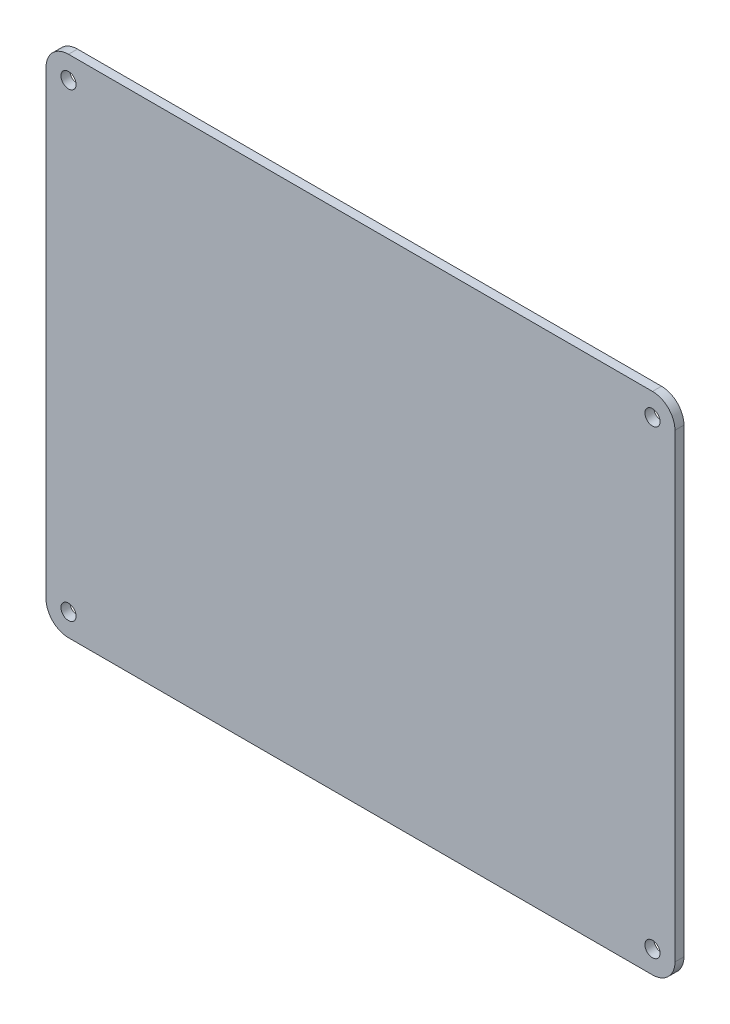
ISO-10303-21;
HEADER;
FILE_DESCRIPTION(('STEP AP214'),'2;1');
FILE_NAME('part.step','',(''),(''),'','','');
FILE_SCHEMA(('AUTOMOTIVE_DESIGN { 1 0 10303 214 1 1 1 1 }'));
ENDSEC;
DATA;
#1=APPLICATION_CONTEXT('core data for automotive mechanical design processes');
#2=APPLICATION_PROTOCOL_DEFINITION('international standard','automotive_design',2000,#1);
#3=PRODUCT_CONTEXT('',#1,'mechanical');
#4=PRODUCT('Part','Part','',(#3));
#5=PRODUCT_RELATED_PRODUCT_CATEGORY('part','',(#4));
#6=PRODUCT_DEFINITION_FORMATION('','',#4);
#7=PRODUCT_DEFINITION_CONTEXT('part definition',#1,'design');
#8=PRODUCT_DEFINITION('design','',#6,#7);
#9=PRODUCT_DEFINITION_SHAPE('','',#8);
#10=(LENGTH_UNIT() NAMED_UNIT(*) SI_UNIT(.MILLI.,.METRE.));
#11=(NAMED_UNIT(*) PLANE_ANGLE_UNIT() SI_UNIT($,.RADIAN.));
#12=(NAMED_UNIT(*) SI_UNIT($,.STERADIAN.) SOLID_ANGLE_UNIT());
#13=UNCERTAINTY_MEASURE_WITH_UNIT(LENGTH_MEASURE(1.E-05),#10,'distance_accuracy_value','');
#14=(GEOMETRIC_REPRESENTATION_CONTEXT(3) GLOBAL_UNCERTAINTY_ASSIGNED_CONTEXT((#13)) GLOBAL_UNIT_ASSIGNED_CONTEXT((#10,
#11,#12)) REPRESENTATION_CONTEXT('',''));
#15=CARTESIAN_POINT('',(0.,0.,0.));
#16=DIRECTION('',(0.,0.,1.));
#17=DIRECTION('',(1.,0.,0.));
#18=AXIS2_PLACEMENT_3D('',#15,#16,#17);
#19=CARTESIAN_POINT('',(-52.,-41.,1.6));
#20=DIRECTION('',(0.,0.,1.));
#21=DIRECTION('',(1.,0.,0.));
#22=AXIS2_PLACEMENT_3D('',#19,#20,#21);
#23=PLANE('',#22);
#24=CARTESIAN_POINT('',(52.,-41.,1.6));
#25=DIRECTION('',(0.,0.,1.));
#26=DIRECTION('',(1.,0.,0.));
#27=AXIS2_PLACEMENT_3D('',#24,#25,#26);
#28=CIRCLE('',#27,1.35000000000001);
#29=CARTESIAN_POINT('',(53.35,-41.,1.6));
#30=VERTEX_POINT('',#29);
#31=EDGE_CURVE('E188',#30,#30,#28,.T.);
#32=ORIENTED_EDGE('',*,*,#31,.F.);
#33=EDGE_LOOP('',(#32));
#34=FACE_BOUND('',#33,.T.);
#35=CARTESIAN_POINT('',(-52.,41.,1.6));
#36=DIRECTION('',(0.,0.,1.));
#37=DIRECTION('',(1.,0.,0.));
#38=AXIS2_PLACEMENT_3D('',#35,#36,#37);
#39=CIRCLE('',#38,1.35);
#40=CARTESIAN_POINT('',(-50.65,41.,1.6));
#41=VERTEX_POINT('',#40);
#42=EDGE_CURVE('E134',#41,#41,#39,.T.);
#43=ORIENTED_EDGE('',*,*,#42,.F.);
#44=EDGE_LOOP('',(#43));
#45=FACE_BOUND('',#44,.T.);
#46=CARTESIAN_POINT('',(-52.,-41.,1.6));
#47=DIRECTION('',(0.,0.,1.));
#48=DIRECTION('',(1.,0.,0.));
#49=AXIS2_PLACEMENT_3D('',#46,#47,#48);
#50=CIRCLE('',#49,4.);
#51=CARTESIAN_POINT('',(-56.,-41.,1.6));
#52=VERTEX_POINT('',#51);
#53=CARTESIAN_POINT('',(-52.,-45.,1.6));
#54=VERTEX_POINT('',#53);
#55=EDGE_CURVE('E145',#52,#54,#50,.T.);
#56=ORIENTED_EDGE('',*,*,#55,.T.);
#57=DIRECTION('',(1.,0.,0.));
#58=VECTOR('',#57,1.);
#59=CARTESIAN_POINT('',(-52.,-45.,1.6));
#60=LINE('',#59,#58);
#61=CARTESIAN_POINT('',(52.,-45.,1.6));
#62=VERTEX_POINT('',#61);
#63=EDGE_CURVE('E93',#54,#62,#60,.T.);
#64=ORIENTED_EDGE('',*,*,#63,.T.);
#65=CARTESIAN_POINT('',(52.,-41.,1.6));
#66=DIRECTION('',(0.,0.,1.));
#67=DIRECTION('',(1.,0.,0.));
#68=AXIS2_PLACEMENT_3D('',#65,#66,#67);
#69=CIRCLE('',#68,4.);
#70=CARTESIAN_POINT('',(56.,-41.,1.6));
#71=VERTEX_POINT('',#70);
#72=EDGE_CURVE('E160',#62,#71,#69,.T.);
#73=ORIENTED_EDGE('',*,*,#72,.T.);
#74=DIRECTION('',(0.,1.,0.));
#75=VECTOR('',#74,1.);
#76=CARTESIAN_POINT('',(56.,-41.,1.6));
#77=LINE('',#76,#75);
#78=CARTESIAN_POINT('',(56.,41.,1.6));
#79=VERTEX_POINT('',#78);
#80=EDGE_CURVE('E173',#71,#79,#77,.T.);
#81=ORIENTED_EDGE('',*,*,#80,.T.);
#82=CARTESIAN_POINT('',(52.,41.,1.6));
#83=DIRECTION('',(0.,0.,1.));
#84=DIRECTION('',(1.,0.,0.));
#85=AXIS2_PLACEMENT_3D('',#82,#83,#84);
#86=CIRCLE('',#85,4.);
#87=CARTESIAN_POINT('',(52.,45.,1.6));
#88=VERTEX_POINT('',#87);
#89=EDGE_CURVE('E112',#79,#88,#86,.T.);
#90=ORIENTED_EDGE('',*,*,#89,.T.);
#91=DIRECTION('',(-1.,0.,0.));
#92=VECTOR('',#91,1.);
#93=CARTESIAN_POINT('',(-52.,45.,1.6));
#94=LINE('',#93,#92);
#95=CARTESIAN_POINT('',(-52.,45.,1.6));
#96=VERTEX_POINT('',#95);
#97=EDGE_CURVE('E106',#88,#96,#94,.T.);
#98=ORIENTED_EDGE('',*,*,#97,.T.);
#99=CARTESIAN_POINT('',(-52.,41.,1.6));
#100=DIRECTION('',(0.,0.,1.));
#101=DIRECTION('',(-1.,0.,0.));
#102=AXIS2_PLACEMENT_3D('',#99,#100,#101);
#103=CIRCLE('',#102,4.);
#104=CARTESIAN_POINT('',(-56.,41.,1.6));
#105=VERTEX_POINT('',#104);
#106=EDGE_CURVE('E110',#96,#105,#103,.T.);
#107=ORIENTED_EDGE('',*,*,#106,.T.);
#108=DIRECTION('',(0.,-1.,0.));
#109=VECTOR('',#108,1.);
#110=CARTESIAN_POINT('',(-56.,-41.,1.6));
#111=LINE('',#110,#109);
#112=EDGE_CURVE('E50',#105,#52,#111,.T.);
#113=ORIENTED_EDGE('',*,*,#112,.T.);
#114=EDGE_LOOP('',(#56,#64,#73,#81,#90,#98,#107,#113));
#115=FACE_BOUND('',#114,.T.);
#116=CARTESIAN_POINT('',(52.,41.,1.6));
#117=DIRECTION('',(0.,0.,1.));
#118=DIRECTION('',(1.,0.,0.));
#119=AXIS2_PLACEMENT_3D('',#116,#117,#118);
#120=CIRCLE('',#119,1.35);
#121=CARTESIAN_POINT('',(53.35,41.,1.6));
#122=VERTEX_POINT('',#121);
#123=EDGE_CURVE('E182',#122,#122,#120,.T.);
#124=ORIENTED_EDGE('',*,*,#123,.F.);
#125=EDGE_LOOP('',(#124));
#126=FACE_BOUND('',#125,.T.);
#127=CARTESIAN_POINT('',(-52.,-41.,1.6));
#128=DIRECTION('',(0.,0.,1.));
#129=DIRECTION('',(1.,0.,0.));
#130=AXIS2_PLACEMENT_3D('',#127,#128,#129);
#131=CIRCLE('',#130,1.35000000000001);
#132=CARTESIAN_POINT('',(-50.65,-41.,1.6));
#133=VERTEX_POINT('',#132);
#134=EDGE_CURVE('E194',#133,#133,#131,.T.);
#135=ORIENTED_EDGE('',*,*,#134,.F.);
#136=EDGE_LOOP('',(#135));
#137=FACE_BOUND('',#136,.T.);
#138=ADVANCED_FACE('F33',(#34,#45,#115,#126,#137),#23,.T.);
#139=CARTESIAN_POINT('',(-52.,-41.,0.));
#140=DIRECTION('',(0.,0.,1.));
#141=DIRECTION('',(1.,0.,0.));
#142=AXIS2_PLACEMENT_3D('',#139,#140,#141);
#143=PLANE('',#142);
#144=CARTESIAN_POINT('',(-52.,-41.,0.));
#145=DIRECTION('',(0.,0.,1.));
#146=DIRECTION('',(1.,0.,0.));
#147=AXIS2_PLACEMENT_3D('',#144,#145,#146);
#148=CIRCLE('',#147,4.);
#149=CARTESIAN_POINT('',(-56.,-41.,0.));
#150=VERTEX_POINT('',#149);
#151=CARTESIAN_POINT('',(-52.,-45.,0.));
#152=VERTEX_POINT('',#151);
#153=EDGE_CURVE('E130',#150,#152,#148,.T.);
#154=ORIENTED_EDGE('',*,*,#153,.F.);
#155=DIRECTION('',(0.,-1.,0.));
#156=VECTOR('',#155,1.);
#157=CARTESIAN_POINT('',(-56.,-41.,0.));
#158=LINE('',#157,#156);
#159=CARTESIAN_POINT('',(-56.,41.,0.));
#160=VERTEX_POINT('',#159);
#161=EDGE_CURVE('E85',#160,#150,#158,.T.);
#162=ORIENTED_EDGE('',*,*,#161,.F.);
#163=CARTESIAN_POINT('',(-52.,41.,0.));
#164=DIRECTION('',(0.,0.,1.));
#165=DIRECTION('',(-1.,0.,0.));
#166=AXIS2_PLACEMENT_3D('',#163,#164,#165);
#167=CIRCLE('',#166,4.);
#168=CARTESIAN_POINT('',(-52.,45.,0.));
#169=VERTEX_POINT('',#168);
#170=EDGE_CURVE('E79',#169,#160,#167,.T.);
#171=ORIENTED_EDGE('',*,*,#170,.F.);
#172=DIRECTION('',(-1.,0.,0.));
#173=VECTOR('',#172,1.);
#174=CARTESIAN_POINT('',(-52.,45.,0.));
#175=LINE('',#174,#173);
#176=CARTESIAN_POINT('',(52.,45.,0.));
#177=VERTEX_POINT('',#176);
#178=EDGE_CURVE('E120',#177,#169,#175,.T.);
#179=ORIENTED_EDGE('',*,*,#178,.F.);
#180=CARTESIAN_POINT('',(52.,41.,0.));
#181=DIRECTION('',(0.,0.,1.));
#182=DIRECTION('',(1.,0.,0.));
#183=AXIS2_PLACEMENT_3D('',#180,#181,#182);
#184=CIRCLE('',#183,4.);
#185=CARTESIAN_POINT('',(56.,41.,0.));
#186=VERTEX_POINT('',#185);
#187=EDGE_CURVE('E140',#186,#177,#184,.T.);
#188=ORIENTED_EDGE('',*,*,#187,.F.);
#189=DIRECTION('',(0.,1.,0.));
#190=VECTOR('',#189,1.);
#191=CARTESIAN_POINT('',(56.,-41.,0.));
#192=LINE('',#191,#190);
#193=CARTESIAN_POINT('',(56.,-41.,0.));
#194=VERTEX_POINT('',#193);
#195=EDGE_CURVE('E138',#194,#186,#192,.T.);
#196=ORIENTED_EDGE('',*,*,#195,.F.);
#197=CARTESIAN_POINT('',(52.,-41.,0.));
#198=DIRECTION('',(0.,0.,1.));
#199=DIRECTION('',(1.,0.,0.));
#200=AXIS2_PLACEMENT_3D('',#197,#198,#199);
#201=CIRCLE('',#200,4.);
#202=CARTESIAN_POINT('',(52.,-45.,0.));
#203=VERTEX_POINT('',#202);
#204=EDGE_CURVE('E136',#203,#194,#201,.T.);
#205=ORIENTED_EDGE('',*,*,#204,.F.);
#206=DIRECTION('',(1.,0.,0.));
#207=VECTOR('',#206,1.);
#208=CARTESIAN_POINT('',(-52.,-45.,0.));
#209=LINE('',#208,#207);
#210=EDGE_CURVE('E133',#152,#203,#209,.T.);
#211=ORIENTED_EDGE('',*,*,#210,.F.);
#212=EDGE_LOOP('',(#154,#162,#171,#179,#188,#196,#205,#211));
#213=FACE_BOUND('',#212,.T.);
#214=CARTESIAN_POINT('',(-52.,41.,0.));
#215=DIRECTION('',(0.,0.,1.));
#216=DIRECTION('',(1.,0.,0.));
#217=AXIS2_PLACEMENT_3D('',#214,#215,#216);
#218=CIRCLE('',#217,1.35);
#219=CARTESIAN_POINT('',(-50.65,41.,0.));
#220=VERTEX_POINT('',#219);
#221=EDGE_CURVE('E179',#220,#220,#218,.T.);
#222=ORIENTED_EDGE('',*,*,#221,.T.);
#223=EDGE_LOOP('',(#222));
#224=FACE_BOUND('',#223,.T.);
#225=CARTESIAN_POINT('',(52.,41.,0.));
#226=DIRECTION('',(0.,0.,1.));
#227=DIRECTION('',(1.,0.,0.));
#228=AXIS2_PLACEMENT_3D('',#225,#226,#227);
#229=CIRCLE('',#228,1.35);
#230=CARTESIAN_POINT('',(53.35,41.,0.));
#231=VERTEX_POINT('',#230);
#232=EDGE_CURVE('E185',#231,#231,#229,.T.);
#233=ORIENTED_EDGE('',*,*,#232,.T.);
#234=EDGE_LOOP('',(#233));
#235=FACE_BOUND('',#234,.T.);
#236=CARTESIAN_POINT('',(52.,-41.,0.));
#237=DIRECTION('',(0.,0.,1.));
#238=DIRECTION('',(1.,0.,0.));
#239=AXIS2_PLACEMENT_3D('',#236,#237,#238);
#240=CIRCLE('',#239,1.35000000000001);
#241=CARTESIAN_POINT('',(53.35,-41.,0.));
#242=VERTEX_POINT('',#241);
#243=EDGE_CURVE('E191',#242,#242,#240,.T.);
#244=ORIENTED_EDGE('',*,*,#243,.T.);
#245=EDGE_LOOP('',(#244));
#246=FACE_BOUND('',#245,.T.);
#247=CARTESIAN_POINT('',(-52.,-41.,0.));
#248=DIRECTION('',(0.,0.,1.));
#249=DIRECTION('',(1.,0.,0.));
#250=AXIS2_PLACEMENT_3D('',#247,#248,#249);
#251=CIRCLE('',#250,1.35000000000001);
#252=CARTESIAN_POINT('',(-50.65,-41.,0.));
#253=VERTEX_POINT('',#252);
#254=EDGE_CURVE('E197',#253,#253,#251,.T.);
#255=ORIENTED_EDGE('',*,*,#254,.T.);
#256=EDGE_LOOP('',(#255));
#257=FACE_BOUND('',#256,.T.);
#258=ADVANCED_FACE('F164',(#213,#224,#235,#246,#257),#143,.F.);
#259=CARTESIAN_POINT('',(-52.,-41.,1.6));
#260=DIRECTION('',(0.,0.,-1.));
#261=DIRECTION('',(-1.,0.,0.));
#262=AXIS2_PLACEMENT_3D('',#259,#260,#261);
#263=CYLINDRICAL_SURFACE('',#262,4.);
#264=ORIENTED_EDGE('',*,*,#153,.T.);
#265=DIRECTION('',(0.,0.,-1.));
#266=VECTOR('',#265,1.);
#267=CARTESIAN_POINT('',(-52.,-45.,1.6));
#268=LINE('',#267,#266);
#269=EDGE_CURVE('E11',#54,#152,#268,.T.);
#270=ORIENTED_EDGE('',*,*,#269,.F.);
#271=ORIENTED_EDGE('',*,*,#55,.F.);
#272=DIRECTION('',(0.,0.,-1.));
#273=VECTOR('',#272,1.);
#274=CARTESIAN_POINT('',(-56.,-41.,1.6));
#275=LINE('',#274,#273);
#276=EDGE_CURVE('E126',#52,#150,#275,.T.);
#277=ORIENTED_EDGE('',*,*,#276,.T.);
#278=EDGE_LOOP('',(#264,#270,#271,#277));
#279=FACE_BOUND('',#278,.T.);
#280=ADVANCED_FACE('F35',(#279),#263,.T.);
#281=CARTESIAN_POINT('',(-52.,-45.,1.6));
#282=DIRECTION('',(0.,1.,0.));
#283=DIRECTION('',(0.,0.,1.));
#284=AXIS2_PLACEMENT_3D('',#281,#282,#283);
#285=PLANE('',#284);
#286=ORIENTED_EDGE('',*,*,#210,.T.);
#287=DIRECTION('',(0.,0.,-1.));
#288=VECTOR('',#287,1.);
#289=CARTESIAN_POINT('',(52.,-45.,1.6));
#290=LINE('',#289,#288);
#291=EDGE_CURVE('E42',#62,#203,#290,.T.);
#292=ORIENTED_EDGE('',*,*,#291,.F.);
#293=ORIENTED_EDGE('',*,*,#63,.F.);
#294=ORIENTED_EDGE('',*,*,#269,.T.);
#295=EDGE_LOOP('',(#286,#292,#293,#294));
#296=FACE_BOUND('',#295,.T.);
#297=ADVANCED_FACE('F231',(#296),#285,.F.);
#298=CARTESIAN_POINT('',(52.,-41.,1.6));
#299=DIRECTION('',(0.,0.,-1.));
#300=DIRECTION('',(-1.,0.,0.));
#301=AXIS2_PLACEMENT_3D('',#298,#299,#300);
#302=CYLINDRICAL_SURFACE('',#301,4.);
#303=ORIENTED_EDGE('',*,*,#204,.T.);
#304=DIRECTION('',(0.,0.,-1.));
#305=VECTOR('',#304,1.);
#306=CARTESIAN_POINT('',(56.,-41.,1.6));
#307=LINE('',#306,#305);
#308=EDGE_CURVE('E152',#71,#194,#307,.T.);
#309=ORIENTED_EDGE('',*,*,#308,.F.);
#310=ORIENTED_EDGE('',*,*,#72,.F.);
#311=ORIENTED_EDGE('',*,*,#291,.T.);
#312=EDGE_LOOP('',(#303,#309,#310,#311));
#313=FACE_BOUND('',#312,.T.);
#314=ADVANCED_FACE('F158',(#313),#302,.T.);
#315=CARTESIAN_POINT('',(56.,-41.,1.6));
#316=DIRECTION('',(-1.,0.,0.));
#317=DIRECTION('',(0.,0.,1.));
#318=AXIS2_PLACEMENT_3D('',#315,#316,#317);
#319=PLANE('',#318);
#320=ORIENTED_EDGE('',*,*,#195,.T.);
#321=DIRECTION('',(0.,0.,-1.));
#322=VECTOR('',#321,1.);
#323=CARTESIAN_POINT('',(56.,41.,1.6));
#324=LINE('',#323,#322);
#325=EDGE_CURVE('E149',#79,#186,#324,.T.);
#326=ORIENTED_EDGE('',*,*,#325,.F.);
#327=ORIENTED_EDGE('',*,*,#80,.F.);
#328=ORIENTED_EDGE('',*,*,#308,.T.);
#329=EDGE_LOOP('',(#320,#326,#327,#328));
#330=FACE_BOUND('',#329,.T.);
#331=ADVANCED_FACE('F169',(#330),#319,.F.);
#332=CARTESIAN_POINT('',(52.,41.,1.6));
#333=DIRECTION('',(0.,0.,-1.));
#334=DIRECTION('',(-1.,0.,0.));
#335=AXIS2_PLACEMENT_3D('',#332,#333,#334);
#336=CYLINDRICAL_SURFACE('',#335,4.);
#337=ORIENTED_EDGE('',*,*,#187,.T.);
#338=DIRECTION('',(0.,0.,-1.));
#339=VECTOR('',#338,1.);
#340=CARTESIAN_POINT('',(52.,45.,1.6));
#341=LINE('',#340,#339);
#342=EDGE_CURVE('E121',#88,#177,#341,.T.);
#343=ORIENTED_EDGE('',*,*,#342,.F.);
#344=ORIENTED_EDGE('',*,*,#89,.F.);
#345=ORIENTED_EDGE('',*,*,#325,.T.);
#346=EDGE_LOOP('',(#337,#343,#344,#345));
#347=FACE_BOUND('',#346,.T.);
#348=ADVANCED_FACE('F172',(#347),#336,.T.);
#349=CARTESIAN_POINT('',(-52.,45.,1.6));
#350=DIRECTION('',(0.,-1.,0.));
#351=DIRECTION('',(0.,0.,-1.));
#352=AXIS2_PLACEMENT_3D('',#349,#350,#351);
#353=PLANE('',#352);
#354=ORIENTED_EDGE('',*,*,#178,.T.);
#355=DIRECTION('',(0.,0.,-1.));
#356=VECTOR('',#355,1.);
#357=CARTESIAN_POINT('',(-52.,45.,1.6));
#358=LINE('',#357,#356);
#359=EDGE_CURVE('E117',#96,#169,#358,.T.);
#360=ORIENTED_EDGE('',*,*,#359,.F.);
#361=ORIENTED_EDGE('',*,*,#97,.F.);
#362=ORIENTED_EDGE('',*,*,#342,.T.);
#363=EDGE_LOOP('',(#354,#360,#361,#362));
#364=FACE_BOUND('',#363,.T.);
#365=ADVANCED_FACE('F118',(#364),#353,.F.);
#366=CARTESIAN_POINT('',(-52.,41.,1.6));
#367=DIRECTION('',(0.,0.,-1.));
#368=DIRECTION('',(-1.,0.,0.));
#369=AXIS2_PLACEMENT_3D('',#366,#367,#368);
#370=CYLINDRICAL_SURFACE('',#369,4.);
#371=ORIENTED_EDGE('',*,*,#170,.T.);
#372=DIRECTION('',(0.,0.,-1.));
#373=VECTOR('',#372,1.);
#374=CARTESIAN_POINT('',(-56.,41.,1.6));
#375=LINE('',#374,#373);
#376=EDGE_CURVE('E122',#105,#160,#375,.T.);
#377=ORIENTED_EDGE('',*,*,#376,.F.);
#378=ORIENTED_EDGE('',*,*,#106,.F.);
#379=ORIENTED_EDGE('',*,*,#359,.T.);
#380=EDGE_LOOP('',(#371,#377,#378,#379));
#381=FACE_BOUND('',#380,.T.);
#382=ADVANCED_FACE('F124',(#381),#370,.T.);
#383=CARTESIAN_POINT('',(-56.,-41.,1.6));
#384=DIRECTION('',(1.,0.,0.));
#385=DIRECTION('',(0.,0.,-1.));
#386=AXIS2_PLACEMENT_3D('',#383,#384,#385);
#387=PLANE('',#386);
#388=ORIENTED_EDGE('',*,*,#161,.T.);
#389=ORIENTED_EDGE('',*,*,#276,.F.);
#390=ORIENTED_EDGE('',*,*,#112,.F.);
#391=ORIENTED_EDGE('',*,*,#376,.T.);
#392=EDGE_LOOP('',(#388,#389,#390,#391));
#393=FACE_BOUND('',#392,.T.);
#394=ADVANCED_FACE('F219',(#393),#387,.F.);
#395=CARTESIAN_POINT('',(-52.,41.,1.6));
#396=DIRECTION('',(0.,0.,-1.));
#397=DIRECTION('',(-1.,0.,0.));
#398=AXIS2_PLACEMENT_3D('',#395,#396,#397);
#399=CYLINDRICAL_SURFACE('',#398,1.35);
#400=ORIENTED_EDGE('',*,*,#42,.T.);
#401=EDGE_LOOP('',(#400));
#402=FACE_BOUND('',#401,.T.);
#403=ORIENTED_EDGE('',*,*,#221,.F.);
#404=EDGE_LOOP('',(#403));
#405=FACE_BOUND('',#404,.T.);
#406=ADVANCED_FACE('F216',(#402,#405),#399,.F.);
#407=CARTESIAN_POINT('',(52.,41.,1.6));
#408=DIRECTION('',(0.,0.,-1.));
#409=DIRECTION('',(-1.,0.,0.));
#410=AXIS2_PLACEMENT_3D('',#407,#408,#409);
#411=CYLINDRICAL_SURFACE('',#410,1.35);
#412=ORIENTED_EDGE('',*,*,#123,.T.);
#413=EDGE_LOOP('',(#412));
#414=FACE_BOUND('',#413,.T.);
#415=ORIENTED_EDGE('',*,*,#232,.F.);
#416=EDGE_LOOP('',(#415));
#417=FACE_BOUND('',#416,.T.);
#418=ADVANCED_FACE('F295',(#414,#417),#411,.F.);
#419=CARTESIAN_POINT('',(52.,-41.,1.6));
#420=DIRECTION('',(0.,0.,-1.));
#421=DIRECTION('',(-1.,0.,0.));
#422=AXIS2_PLACEMENT_3D('',#419,#420,#421);
#423=CYLINDRICAL_SURFACE('',#422,1.35000000000001);
#424=ORIENTED_EDGE('',*,*,#31,.T.);
#425=EDGE_LOOP('',(#424));
#426=FACE_BOUND('',#425,.T.);
#427=ORIENTED_EDGE('',*,*,#243,.F.);
#428=EDGE_LOOP('',(#427));
#429=FACE_BOUND('',#428,.T.);
#430=ADVANCED_FACE('F303',(#426,#429),#423,.F.);
#431=CARTESIAN_POINT('',(-52.,-41.,1.6));
#432=DIRECTION('',(0.,0.,-1.));
#433=DIRECTION('',(-1.,0.,0.));
#434=AXIS2_PLACEMENT_3D('',#431,#432,#433);
#435=CYLINDRICAL_SURFACE('',#434,1.35000000000001);
#436=ORIENTED_EDGE('',*,*,#134,.T.);
#437=EDGE_LOOP('',(#436));
#438=FACE_BOUND('',#437,.T.);
#439=ORIENTED_EDGE('',*,*,#254,.F.);
#440=EDGE_LOOP('',(#439));
#441=FACE_BOUND('',#440,.T.);
#442=ADVANCED_FACE('F203',(#438,#441),#435,.F.);
#443=CLOSED_SHELL('',(#138,#258,#280,#297,#314,#331,#348,#365,#382,#394,#406,#418,#430,#442));
#444=MANIFOLD_SOLID_BREP('B2',#443);
#445=ADVANCED_BREP_SHAPE_REPRESENTATION('',(#18,#444),#14);
#446=SHAPE_DEFINITION_REPRESENTATION(#9,#445);
ENDSEC;
END-ISO-10303-21;
